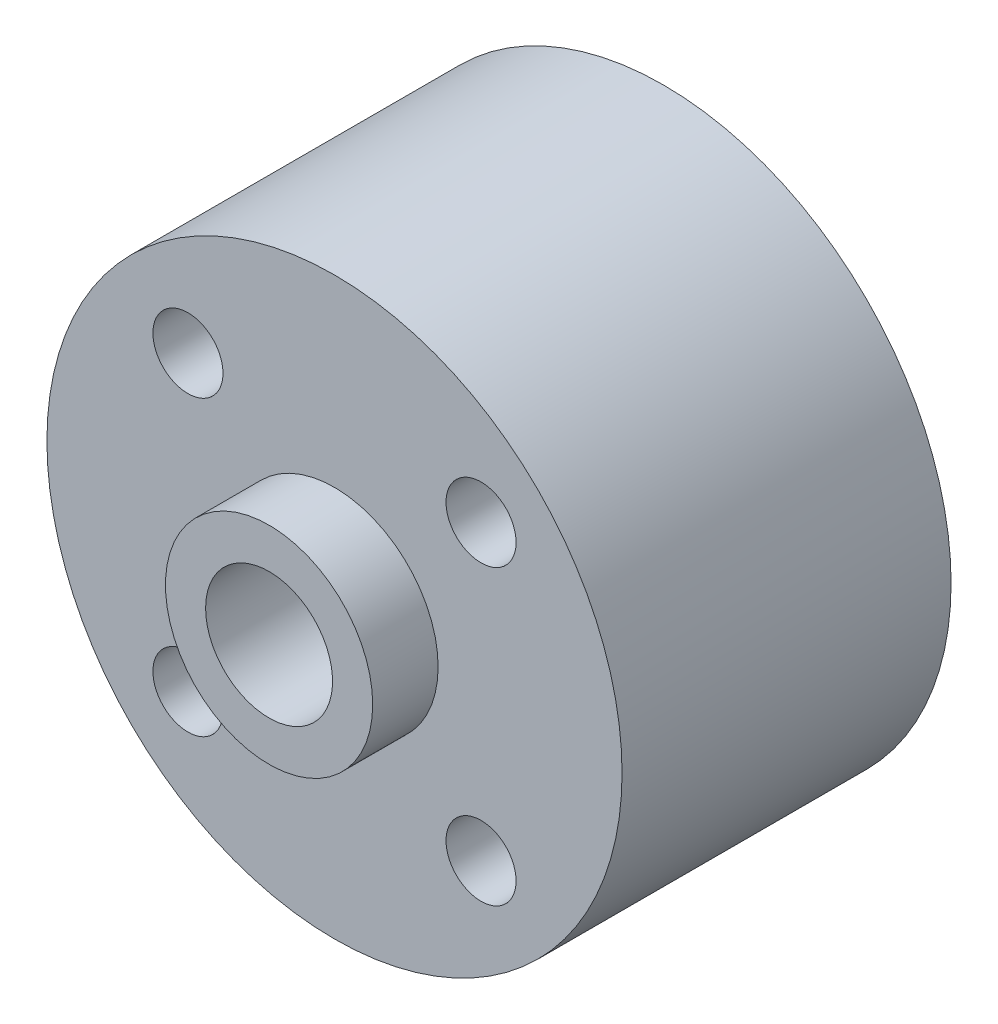
ISO-10303-21;
HEADER;
FILE_DESCRIPTION(('STEP AP214'),'2;1');
FILE_NAME('part.step','',(''),(''),'','','');
FILE_SCHEMA(('AUTOMOTIVE_DESIGN { 1 0 10303 214 1 1 1 1 }'));
ENDSEC;
DATA;
#1=APPLICATION_CONTEXT('core data for automotive mechanical design processes');
#2=APPLICATION_PROTOCOL_DEFINITION('international standard','automotive_design',2000,#1);
#3=PRODUCT_CONTEXT('',#1,'mechanical');
#4=PRODUCT('Part','Part','',(#3));
#5=PRODUCT_RELATED_PRODUCT_CATEGORY('part','',(#4));
#6=PRODUCT_DEFINITION_FORMATION('','',#4);
#7=PRODUCT_DEFINITION_CONTEXT('part definition',#1,'design');
#8=PRODUCT_DEFINITION('design','',#6,#7);
#9=PRODUCT_DEFINITION_SHAPE('','',#8);
#10=(LENGTH_UNIT() NAMED_UNIT(*) SI_UNIT(.MILLI.,.METRE.));
#11=(NAMED_UNIT(*) PLANE_ANGLE_UNIT() SI_UNIT($,.RADIAN.));
#12=(NAMED_UNIT(*) SI_UNIT($,.STERADIAN.) SOLID_ANGLE_UNIT());
#13=UNCERTAINTY_MEASURE_WITH_UNIT(LENGTH_MEASURE(1.E-05),#10,'distance_accuracy_value','');
#14=(GEOMETRIC_REPRESENTATION_CONTEXT(3) GLOBAL_UNCERTAINTY_ASSIGNED_CONTEXT((#13)) GLOBAL_UNIT_ASSIGNED_CONTEXT((#10,
#11,#12)) REPRESENTATION_CONTEXT('',''));
#15=CARTESIAN_POINT('',(0.,0.,0.));
#16=DIRECTION('',(0.,0.,1.));
#17=DIRECTION('',(1.,0.,0.));
#18=AXIS2_PLACEMENT_3D('',#15,#16,#17);
#19=CARTESIAN_POINT('',(0.,0.,10.65));
#20=DIRECTION('',(0.,0.,-1.));
#21=DIRECTION('',(-1.,0.,0.));
#22=AXIS2_PLACEMENT_3D('',#19,#20,#21);
#23=CYLINDRICAL_SURFACE('',#22,2.45);
#24=CARTESIAN_POINT('',(0.,0.,8.875));
#25=DIRECTION('',(0.,0.,-1.));
#26=DIRECTION('',(-1.,0.,0.));
#27=AXIS2_PLACEMENT_3D('',#24,#25,#26);
#28=CIRCLE('',#27,2.45);
#29=CARTESIAN_POINT('',(-2.45,0.,8.875));
#30=VERTEX_POINT('',#29);
#31=EDGE_CURVE('E19',#30,#30,#28,.T.);
#32=ORIENTED_EDGE('',*,*,#31,.F.);
#33=EDGE_LOOP('',(#32));
#34=FACE_BOUND('',#33,.T.);
#35=CARTESIAN_POINT('',(0.,0.,-8.875));
#36=DIRECTION('',(0.,0.,-1.));
#37=DIRECTION('',(-1.,0.,0.));
#38=AXIS2_PLACEMENT_3D('',#35,#36,#37);
#39=CIRCLE('',#38,2.45);
#40=CARTESIAN_POINT('',(-2.45,0.,-8.875));
#41=VERTEX_POINT('',#40);
#42=EDGE_CURVE('E65',#41,#41,#39,.T.);
#43=ORIENTED_EDGE('',*,*,#42,.T.);
#44=EDGE_LOOP('',(#43));
#45=FACE_BOUND('',#44,.T.);
#46=ADVANCED_FACE('F16',(#34,#45),#23,.F.);
#47=CARTESIAN_POINT('',(0.,0.,8.875));
#48=DIRECTION('',(0.,0.,1.));
#49=DIRECTION('',(1.,0.,0.));
#50=AXIS2_PLACEMENT_3D('',#47,#48,#49);
#51=PLANE('',#50);
#52=ORIENTED_EDGE('',*,*,#31,.T.);
#53=EDGE_LOOP('',(#52));
#54=FACE_BOUND('',#53,.T.);
#55=CARTESIAN_POINT('',(0.,0.,8.875));
#56=DIRECTION('',(0.,0.,1.));
#57=DIRECTION('',(1.,0.,0.));
#58=AXIS2_PLACEMENT_3D('',#55,#56,#57);
#59=CIRCLE('',#58,4.);
#60=CARTESIAN_POINT('',(4.,0.,8.875));
#61=VERTEX_POINT('',#60);
#62=EDGE_CURVE('E63',#61,#61,#59,.F.);
#63=ORIENTED_EDGE('',*,*,#62,.F.);
#64=EDGE_LOOP('',(#63));
#65=FACE_BOUND('',#64,.T.);
#66=ADVANCED_FACE('F72',(#54,#65),#51,.T.);
#67=CARTESIAN_POINT('',(0.,0.,-8.875));
#68=DIRECTION('',(0.,0.,1.));
#69=DIRECTION('',(1.,0.,0.));
#70=AXIS2_PLACEMENT_3D('',#67,#68,#69);
#71=PLANE('',#70);
#72=ORIENTED_EDGE('',*,*,#42,.F.);
#73=EDGE_LOOP('',(#72));
#74=FACE_BOUND('',#73,.T.);
#75=CARTESIAN_POINT('',(0.,0.,-8.875));
#76=DIRECTION('',(0.,0.,1.));
#77=DIRECTION('',(1.,0.,0.));
#78=AXIS2_PLACEMENT_3D('',#75,#76,#77);
#79=CIRCLE('',#78,4.);
#80=CARTESIAN_POINT('',(4.,0.,-8.875));
#81=VERTEX_POINT('',#80);
#82=EDGE_CURVE('E60',#81,#81,#79,.T.);
#83=ORIENTED_EDGE('',*,*,#82,.F.);
#84=EDGE_LOOP('',(#83));
#85=FACE_BOUND('',#84,.T.);
#86=ADVANCED_FACE('F79',(#74,#85),#71,.F.);
#87=CARTESIAN_POINT('',(0.,0.,-8.875));
#88=DIRECTION('',(0.,0.,1.));
#89=DIRECTION('',(1.,0.,0.));
#90=AXIS2_PLACEMENT_3D('',#87,#88,#89);
#91=CYLINDRICAL_SURFACE('',#90,4.);
#92=ORIENTED_EDGE('',*,*,#62,.T.);
#93=EDGE_LOOP('',(#92));
#94=FACE_BOUND('',#93,.T.);
#95=CARTESIAN_POINT('',(0.,0.,6.35));
#96=DIRECTION('',(0.,0.,1.));
#97=DIRECTION('',(1.,0.,0.));
#98=AXIS2_PLACEMENT_3D('',#95,#96,#97);
#99=CIRCLE('',#98,4.);
#100=CARTESIAN_POINT('',(4.,0.,6.35));
#101=VERTEX_POINT('',#100);
#102=EDGE_CURVE('E57',#101,#101,#99,.F.);
#103=ORIENTED_EDGE('',*,*,#102,.F.);
#104=EDGE_LOOP('',(#103));
#105=FACE_BOUND('',#104,.T.);
#106=ADVANCED_FACE('F114',(#94,#105),#91,.T.);
#107=CARTESIAN_POINT('',(0.,0.,-8.875));
#108=DIRECTION('',(0.,0.,1.));
#109=DIRECTION('',(1.,0.,0.));
#110=AXIS2_PLACEMENT_3D('',#107,#108,#109);
#111=CYLINDRICAL_SURFACE('',#110,4.);
#112=ORIENTED_EDGE('',*,*,#82,.T.);
#113=EDGE_LOOP('',(#112));
#114=FACE_BOUND('',#113,.T.);
#115=CARTESIAN_POINT('',(0.,0.,-6.35));
#116=DIRECTION('',(0.,0.,1.));
#117=DIRECTION('',(1.,0.,0.));
#118=AXIS2_PLACEMENT_3D('',#115,#116,#117);
#119=CIRCLE('',#118,4.);
#120=CARTESIAN_POINT('',(4.,0.,-6.35));
#121=VERTEX_POINT('',#120);
#122=EDGE_CURVE('E42',#121,#121,#119,.F.);
#123=ORIENTED_EDGE('',*,*,#122,.T.);
#124=EDGE_LOOP('',(#123));
#125=FACE_BOUND('',#124,.T.);
#126=ADVANCED_FACE('F110',(#114,#125),#111,.T.);
#127=CARTESIAN_POINT('',(5.65685424949239,5.65685424949238,10.65));
#128=DIRECTION('',(0.,0.,1.));
#129=DIRECTION('',(1.,0.,0.));
#130=AXIS2_PLACEMENT_3D('',#127,#128,#129);
#131=CYLINDRICAL_SURFACE('',#130,1.3525);
#132=CARTESIAN_POINT('',(5.65685424949239,5.65685424949238,-6.35));
#133=DIRECTION('',(0.,0.,1.));
#134=DIRECTION('',(1.,0.,0.));
#135=AXIS2_PLACEMENT_3D('',#132,#133,#134);
#136=CIRCLE('',#135,1.3525);
#137=CARTESIAN_POINT('',(7.00935424949239,5.65685424949238,-6.35));
#138=VERTEX_POINT('',#137);
#139=EDGE_CURVE('E39',#138,#138,#136,.F.);
#140=ORIENTED_EDGE('',*,*,#139,.T.);
#141=EDGE_LOOP('',(#140));
#142=FACE_BOUND('',#141,.T.);
#143=CARTESIAN_POINT('',(5.65685424949239,5.65685424949238,6.35));
#144=DIRECTION('',(0.,0.,1.));
#145=DIRECTION('',(1.,0.,0.));
#146=AXIS2_PLACEMENT_3D('',#143,#144,#145);
#147=CIRCLE('',#146,1.3525);
#148=CARTESIAN_POINT('',(7.00935424949239,5.65685424949238,6.35));
#149=VERTEX_POINT('',#148);
#150=EDGE_CURVE('E54',#149,#149,#147,.F.);
#151=ORIENTED_EDGE('',*,*,#150,.F.);
#152=EDGE_LOOP('',(#151));
#153=FACE_BOUND('',#152,.T.);
#154=ADVANCED_FACE('F106',(#142,#153),#131,.F.);
#155=CARTESIAN_POINT('',(-5.65685424949237,5.65685424949238,10.65));
#156=DIRECTION('',(0.,0.,1.));
#157=DIRECTION('',(1.,0.,0.));
#158=AXIS2_PLACEMENT_3D('',#155,#156,#157);
#159=CYLINDRICAL_SURFACE('',#158,1.3525);
#160=CARTESIAN_POINT('',(-5.65685424949237,5.65685424949238,-6.35));
#161=DIRECTION('',(0.,0.,1.));
#162=DIRECTION('',(1.,0.,0.));
#163=AXIS2_PLACEMENT_3D('',#160,#161,#162);
#164=CIRCLE('',#163,1.3525);
#165=CARTESIAN_POINT('',(-4.30435424949237,5.65685424949238,-6.35));
#166=VERTEX_POINT('',#165);
#167=EDGE_CURVE('E36',#166,#166,#164,.F.);
#168=ORIENTED_EDGE('',*,*,#167,.T.);
#169=EDGE_LOOP('',(#168));
#170=FACE_BOUND('',#169,.T.);
#171=CARTESIAN_POINT('',(-5.65685424949237,5.65685424949238,6.35));
#172=DIRECTION('',(0.,0.,1.));
#173=DIRECTION('',(1.,0.,0.));
#174=AXIS2_PLACEMENT_3D('',#171,#172,#173);
#175=CIRCLE('',#174,1.3525);
#176=CARTESIAN_POINT('',(-4.30435424949237,5.65685424949238,6.35));
#177=VERTEX_POINT('',#176);
#178=EDGE_CURVE('E51',#177,#177,#175,.F.);
#179=ORIENTED_EDGE('',*,*,#178,.F.);
#180=EDGE_LOOP('',(#179));
#181=FACE_BOUND('',#180,.T.);
#182=ADVANCED_FACE('F102',(#170,#181),#159,.F.);
#183=CARTESIAN_POINT('',(-5.65685424949237,-5.65685424949238,10.65));
#184=DIRECTION('',(0.,0.,1.));
#185=DIRECTION('',(1.,0.,0.));
#186=AXIS2_PLACEMENT_3D('',#183,#184,#185);
#187=CYLINDRICAL_SURFACE('',#186,1.3525);
#188=CARTESIAN_POINT('',(-5.65685424949237,-5.65685424949238,-6.35));
#189=DIRECTION('',(0.,0.,1.));
#190=DIRECTION('',(1.,0.,0.));
#191=AXIS2_PLACEMENT_3D('',#188,#189,#190);
#192=CIRCLE('',#191,1.3525);
#193=CARTESIAN_POINT('',(-4.30435424949237,-5.65685424949238,-6.35));
#194=VERTEX_POINT('',#193);
#195=EDGE_CURVE('E33',#194,#194,#192,.F.);
#196=ORIENTED_EDGE('',*,*,#195,.T.);
#197=EDGE_LOOP('',(#196));
#198=FACE_BOUND('',#197,.T.);
#199=CARTESIAN_POINT('',(-5.65685424949237,-5.65685424949238,6.35));
#200=DIRECTION('',(0.,0.,1.));
#201=DIRECTION('',(1.,0.,0.));
#202=AXIS2_PLACEMENT_3D('',#199,#200,#201);
#203=CIRCLE('',#202,1.3525);
#204=CARTESIAN_POINT('',(-4.30435424949237,-5.65685424949238,6.35));
#205=VERTEX_POINT('',#204);
#206=EDGE_CURVE('E48',#205,#205,#203,.F.);
#207=ORIENTED_EDGE('',*,*,#206,.F.);
#208=EDGE_LOOP('',(#207));
#209=FACE_BOUND('',#208,.T.);
#210=ADVANCED_FACE('F98',(#198,#209),#187,.F.);
#211=CARTESIAN_POINT('',(5.65685424949239,-5.65685424949238,10.65));
#212=DIRECTION('',(0.,0.,1.));
#213=DIRECTION('',(1.,0.,0.));
#214=AXIS2_PLACEMENT_3D('',#211,#212,#213);
#215=CYLINDRICAL_SURFACE('',#214,1.3525);
#216=CARTESIAN_POINT('',(5.65685424949239,-5.65685424949238,-6.35));
#217=DIRECTION('',(0.,0.,1.));
#218=DIRECTION('',(1.,0.,0.));
#219=AXIS2_PLACEMENT_3D('',#216,#217,#218);
#220=CIRCLE('',#219,1.3525);
#221=CARTESIAN_POINT('',(7.00935424949239,-5.65685424949238,-6.35));
#222=VERTEX_POINT('',#221);
#223=EDGE_CURVE('E28',#222,#222,#220,.F.);
#224=ORIENTED_EDGE('',*,*,#223,.T.);
#225=EDGE_LOOP('',(#224));
#226=FACE_BOUND('',#225,.T.);
#227=CARTESIAN_POINT('',(5.65685424949239,-5.65685424949238,6.35));
#228=DIRECTION('',(0.,0.,1.));
#229=DIRECTION('',(1.,0.,0.));
#230=AXIS2_PLACEMENT_3D('',#227,#228,#229);
#231=CIRCLE('',#230,1.3525);
#232=CARTESIAN_POINT('',(7.00935424949239,-5.65685424949238,6.35));
#233=VERTEX_POINT('',#232);
#234=EDGE_CURVE('E45',#233,#233,#231,.F.);
#235=ORIENTED_EDGE('',*,*,#234,.F.);
#236=EDGE_LOOP('',(#235));
#237=FACE_BOUND('',#236,.T.);
#238=ADVANCED_FACE('F94',(#226,#237),#215,.F.);
#239=CARTESIAN_POINT('',(0.,0.,6.35));
#240=DIRECTION('',(0.,0.,1.));
#241=DIRECTION('',(1.,0.,0.));
#242=AXIS2_PLACEMENT_3D('',#239,#240,#241);
#243=PLANE('',#242);
#244=ORIENTED_EDGE('',*,*,#234,.T.);
#245=EDGE_LOOP('',(#244));
#246=FACE_BOUND('',#245,.T.);
#247=ORIENTED_EDGE('',*,*,#206,.T.);
#248=EDGE_LOOP('',(#247));
#249=FACE_BOUND('',#248,.T.);
#250=ORIENTED_EDGE('',*,*,#178,.T.);
#251=EDGE_LOOP('',(#250));
#252=FACE_BOUND('',#251,.T.);
#253=ORIENTED_EDGE('',*,*,#150,.T.);
#254=EDGE_LOOP('',(#253));
#255=FACE_BOUND('',#254,.T.);
#256=ORIENTED_EDGE('',*,*,#102,.T.);
#257=EDGE_LOOP('',(#256));
#258=FACE_BOUND('',#257,.T.);
#259=CARTESIAN_POINT('',(0.,0.,6.35));
#260=DIRECTION('',(0.,0.,1.));
#261=DIRECTION('',(1.,0.,0.));
#262=AXIS2_PLACEMENT_3D('',#259,#260,#261);
#263=CIRCLE('',#262,11.1);
#264=CARTESIAN_POINT('',(11.1,0.,6.35));
#265=VERTEX_POINT('',#264);
#266=EDGE_CURVE('E23',#265,#265,#263,.F.);
#267=ORIENTED_EDGE('',*,*,#266,.F.);
#268=EDGE_LOOP('',(#267));
#269=FACE_BOUND('',#268,.T.);
#270=ADVANCED_FACE('F87',(#246,#249,#252,#255,#258,#269),#243,.T.);
#271=CARTESIAN_POINT('',(0.,0.,-6.35));
#272=DIRECTION('',(0.,0.,1.));
#273=DIRECTION('',(1.,0.,0.));
#274=AXIS2_PLACEMENT_3D('',#271,#272,#273);
#275=PLANE('',#274);
#276=ORIENTED_EDGE('',*,*,#223,.F.);
#277=EDGE_LOOP('',(#276));
#278=FACE_BOUND('',#277,.T.);
#279=ORIENTED_EDGE('',*,*,#195,.F.);
#280=EDGE_LOOP('',(#279));
#281=FACE_BOUND('',#280,.T.);
#282=ORIENTED_EDGE('',*,*,#167,.F.);
#283=EDGE_LOOP('',(#282));
#284=FACE_BOUND('',#283,.T.);
#285=ORIENTED_EDGE('',*,*,#139,.F.);
#286=EDGE_LOOP('',(#285));
#287=FACE_BOUND('',#286,.T.);
#288=ORIENTED_EDGE('',*,*,#122,.F.);
#289=EDGE_LOOP('',(#288));
#290=FACE_BOUND('',#289,.T.);
#291=CARTESIAN_POINT('',(0.,0.,-6.35));
#292=DIRECTION('',(0.,0.,1.));
#293=DIRECTION('',(1.,0.,0.));
#294=AXIS2_PLACEMENT_3D('',#291,#292,#293);
#295=CIRCLE('',#294,11.1);
#296=CARTESIAN_POINT('',(11.1,0.,-6.35));
#297=VERTEX_POINT('',#296);
#298=EDGE_CURVE('E10',#297,#297,#295,.T.);
#299=ORIENTED_EDGE('',*,*,#298,.F.);
#300=EDGE_LOOP('',(#299));
#301=FACE_BOUND('',#300,.T.);
#302=ADVANCED_FACE('F82',(#278,#281,#284,#287,#290,#301),#275,.F.);
#303=CARTESIAN_POINT('',(0.,0.,6.35));
#304=DIRECTION('',(0.,0.,1.));
#305=DIRECTION('',(1.,0.,0.));
#306=AXIS2_PLACEMENT_3D('',#303,#304,#305);
#307=CYLINDRICAL_SURFACE('',#306,11.1);
#308=ORIENTED_EDGE('',*,*,#298,.T.);
#309=EDGE_LOOP('',(#308));
#310=FACE_BOUND('',#309,.T.);
#311=ORIENTED_EDGE('',*,*,#266,.T.);
#312=EDGE_LOOP('',(#311));
#313=FACE_BOUND('',#312,.T.);
#314=ADVANCED_FACE('F80',(#310,#313),#307,.T.);
#315=CLOSED_SHELL('',(#46,#66,#86,#106,#126,#154,#182,#210,#238,#270,#302,#314));
#316=MANIFOLD_SOLID_BREP('B1',#315);
#317=ADVANCED_BREP_SHAPE_REPRESENTATION('',(#18,#316),#14);
#318=SHAPE_DEFINITION_REPRESENTATION(#9,#317);
ENDSEC;
END-ISO-10303-21;
